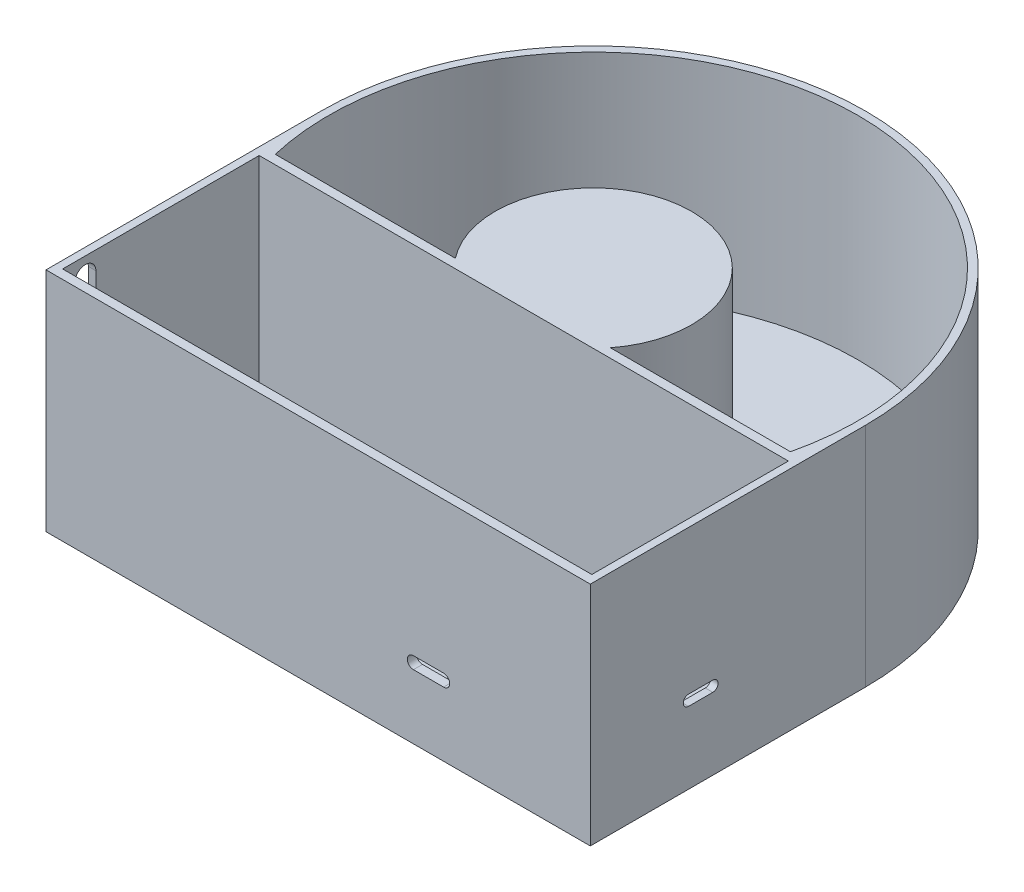
ISO-10303-21;
HEADER;
FILE_DESCRIPTION(('STEP AP214'),'2;1');
FILE_NAME('part.step','',(''),(''),'','','');
FILE_SCHEMA(('AUTOMOTIVE_DESIGN { 1 0 10303 214 1 1 1 1 }'));
ENDSEC;
DATA;
#1=APPLICATION_CONTEXT('core data for automotive mechanical design processes');
#2=APPLICATION_PROTOCOL_DEFINITION('international standard','automotive_design',2000,#1);
#3=PRODUCT_CONTEXT('',#1,'mechanical');
#4=PRODUCT('Part','Part','',(#3));
#5=PRODUCT_RELATED_PRODUCT_CATEGORY('part','',(#4));
#6=PRODUCT_DEFINITION_FORMATION('','',#4);
#7=PRODUCT_DEFINITION_CONTEXT('part definition',#1,'design');
#8=PRODUCT_DEFINITION('design','',#6,#7);
#9=PRODUCT_DEFINITION_SHAPE('','',#8);
#10=(LENGTH_UNIT() NAMED_UNIT(*) SI_UNIT(.MILLI.,.METRE.));
#11=(NAMED_UNIT(*) PLANE_ANGLE_UNIT() SI_UNIT($,.RADIAN.));
#12=(NAMED_UNIT(*) SI_UNIT($,.STERADIAN.) SOLID_ANGLE_UNIT());
#13=UNCERTAINTY_MEASURE_WITH_UNIT(LENGTH_MEASURE(1.E-05),#10,'distance_accuracy_value','');
#14=(GEOMETRIC_REPRESENTATION_CONTEXT(3) GLOBAL_UNCERTAINTY_ASSIGNED_CONTEXT((#13)) GLOBAL_UNIT_ASSIGNED_CONTEXT((#10,
#11,#12)) REPRESENTATION_CONTEXT('',''));
#15=CARTESIAN_POINT('',(0.,0.,0.));
#16=DIRECTION('',(0.,0.,1.));
#17=DIRECTION('',(1.,0.,0.));
#18=AXIS2_PLACEMENT_3D('',#15,#16,#17);
#19=CARTESIAN_POINT('',(0.,4.99999999999999,0.));
#20=DIRECTION('',(0.,1.,0.));
#21=DIRECTION('',(0.,0.,1.));
#22=AXIS2_PLACEMENT_3D('',#19,#20,#21);
#23=PLANE('',#22);
#24=DIRECTION('',(-1.,0.,0.));
#25=VECTOR('',#24,1.);
#26=CARTESIAN_POINT('',(0.,4.99999999999999,20.));
#27=LINE('',#26,#25);
#28=CARTESIAN_POINT('',(-76.4005010509516,4.99999999999999,20.));
#29=VERTEX_POINT('',#28);
#30=CARTESIAN_POINT('',(-85.1836251870041,4.99999999999999,20.));
#31=VERTEX_POINT('',#30);
#32=EDGE_CURVE('E518',#29,#31,#27,.T.);
#33=ORIENTED_EDGE('',*,*,#32,.F.);
#34=DIRECTION('',(0.,0.,1.));
#35=VECTOR('',#34,1.);
#36=CARTESIAN_POINT('',(-76.4005010509516,4.99999999999999,-30.));
#37=LINE('',#36,#35);
#38=CARTESIAN_POINT('',(-76.4005010509516,4.99999999999999,-30.));
#39=VERTEX_POINT('',#38);
#40=EDGE_CURVE('E283',#39,#29,#37,.T.);
#41=ORIENTED_EDGE('',*,*,#40,.F.);
#42=DIRECTION('',(-1.,0.,0.));
#43=VECTOR('',#42,1.);
#44=CARTESIAN_POINT('',(-76.4005010509516,4.99999999999999,-30.));
#45=LINE('',#44,#43);
#46=CARTESIAN_POINT('',(-75.4005010509516,5.,-30.));
#47=VERTEX_POINT('',#46);
#48=EDGE_CURVE('E306',#47,#39,#45,.T.);
#49=ORIENTED_EDGE('',*,*,#48,.F.);
#50=DIRECTION('',(0.,0.,1.));
#51=VECTOR('',#50,1.);
#52=CARTESIAN_POINT('',(-75.4005010509516,5.,-30.));
#53=LINE('',#52,#51);
#54=CARTESIAN_POINT('',(-75.4005010509515,5.,20.));
#55=VERTEX_POINT('',#54);
#56=EDGE_CURVE('E297',#47,#55,#53,.T.);
#57=ORIENTED_EDGE('',*,*,#56,.T.);
#58=CARTESIAN_POINT('',(-55.4005010509515,4.99999999999999,20.));
#59=VERTEX_POINT('',#58);
#60=EDGE_CURVE('E524',#59,#55,#27,.T.);
#61=ORIENTED_EDGE('',*,*,#60,.F.);
#62=DIRECTION('',(0.,0.,1.));
#63=VECTOR('',#62,1.);
#64=CARTESIAN_POINT('',(-55.4005010509516,4.99999999999999,-30.));
#65=LINE('',#64,#63);
#66=CARTESIAN_POINT('',(-55.4005010509516,4.99999999999999,-30.));
#67=VERTEX_POINT('',#66);
#68=EDGE_CURVE('E358',#67,#59,#65,.T.);
#69=ORIENTED_EDGE('',*,*,#68,.F.);
#70=DIRECTION('',(-1.,0.,0.));
#71=VECTOR('',#70,1.);
#72=CARTESIAN_POINT('',(-54.4005010509516,4.99999999999999,-30.));
#73=LINE('',#72,#71);
#74=CARTESIAN_POINT('',(-54.4005010509516,4.99999999999999,-30.));
#75=VERTEX_POINT('',#74);
#76=EDGE_CURVE('E325',#75,#67,#73,.T.);
#77=ORIENTED_EDGE('',*,*,#76,.F.);
#78=DIRECTION('',(0.,0.,1.));
#79=VECTOR('',#78,1.);
#80=CARTESIAN_POINT('',(-54.4005010509516,4.99999999999999,-30.));
#81=LINE('',#80,#79);
#82=CARTESIAN_POINT('',(-54.4005010509515,4.99999999999999,20.));
#83=VERTEX_POINT('',#82);
#84=EDGE_CURVE('E339',#75,#83,#81,.T.);
#85=ORIENTED_EDGE('',*,*,#84,.T.);
#86=CARTESIAN_POINT('',(-25.617376914899,4.99999999999999,20.));
#87=VERTEX_POINT('',#86);
#88=EDGE_CURVE('E519',#87,#83,#27,.T.);
#89=ORIENTED_EDGE('',*,*,#88,.F.);
#90=CARTESIAN_POINT('',(0.,4.99999999999999,0.));
#91=DIRECTION('',(0.,1.,0.));
#92=DIRECTION('',(0.,0.,1.));
#93=AXIS2_PLACEMENT_3D('',#90,#91,#92);
#94=CIRCLE('',#93,32.5);
#95=CARTESIAN_POINT('',(25.617376914899,4.99999999999999,20.));
#96=VERTEX_POINT('',#95);
#97=EDGE_CURVE('E536',#96,#87,#94,.T.);
#98=ORIENTED_EDGE('',*,*,#97,.F.);
#99=CARTESIAN_POINT('',(85.1836251870041,4.99999999999999,20.));
#100=VERTEX_POINT('',#99);
#101=EDGE_CURVE('E525',#100,#96,#27,.T.);
#102=ORIENTED_EDGE('',*,*,#101,.F.);
#103=CARTESIAN_POINT('',(0.,4.99999999999999,0.));
#104=DIRECTION('',(0.,1.,0.));
#105=DIRECTION('',(0.,0.,1.));
#106=AXIS2_PLACEMENT_3D('',#103,#104,#105);
#107=CIRCLE('',#106,87.5);
#108=EDGE_CURVE('E545',#100,#31,#107,.T.);
#109=ORIENTED_EDGE('',*,*,#108,.T.);
#110=EDGE_LOOP('',(#33,#41,#49,#57,#61,#69,#77,#85,#89,#98,#102,#109));
#111=FACE_BOUND('',#110,.T.);
#112=ADVANCED_FACE('F42',(#111),#23,.T.);
#113=CARTESIAN_POINT('',(-90.,0.,20.));
#114=DIRECTION('',(0.,0.,-1.));
#115=DIRECTION('',(-1.,0.,0.));
#116=AXIS2_PLACEMENT_3D('',#113,#114,#115);
#117=PLANE('',#116);
#118=DIRECTION('',(1.,0.,0.));
#119=VECTOR('',#118,1.);
#120=CARTESIAN_POINT('',(-73.6797717418984,7.45745613286697,20.));
#121=LINE('',#120,#119);
#122=CARTESIAN_POINT('',(-74.6797717418984,7.45745613286697,20.));
#123=VERTEX_POINT('',#122);
#124=CARTESIAN_POINT('',(-73.6797717418984,7.45745613286697,20.));
#125=VERTEX_POINT('',#124);
#126=EDGE_CURVE('E305',#123,#125,#121,.T.);
#127=ORIENTED_EDGE('',*,*,#126,.F.);
#128=DIRECTION('',(0.573576436351047,0.819152044288991,0.));
#129=VECTOR('',#128,1.);
#130=CARTESIAN_POINT('',(-74.6797717418984,7.45745613286697,20.));
#131=LINE('',#130,#129);
#132=EDGE_CURVE('E310',#29,#123,#131,.T.);
#133=ORIENTED_EDGE('',*,*,#132,.F.);
#134=ORIENTED_EDGE('',*,*,#32,.T.);
#135=DIRECTION('',(0.,1.,0.));
#136=VECTOR('',#135,1.);
#137=CARTESIAN_POINT('',(-85.1836251870041,4.99999999999999,20.));
#138=LINE('',#137,#136);
#139=CARTESIAN_POINT('',(-85.1836251870041,75.,20.));
#140=VERTEX_POINT('',#139);
#141=EDGE_CURVE('E523',#140,#31,#138,.F.);
#142=ORIENTED_EDGE('',*,*,#141,.F.);
#143=DIRECTION('',(-1.,0.,0.));
#144=VECTOR('',#143,1.);
#145=CARTESIAN_POINT('',(-90.,75.,20.));
#146=LINE('',#145,#144);
#147=CARTESIAN_POINT('',(-25.617376914899,75.,20.));
#148=VERTEX_POINT('',#147);
#149=EDGE_CURVE('E506',#148,#140,#146,.T.);
#150=ORIENTED_EDGE('',*,*,#149,.F.);
#151=DIRECTION('',(0.,-1.,0.));
#152=VECTOR('',#151,1.);
#153=CARTESIAN_POINT('',(-25.617376914899,75.,20.));
#154=LINE('',#153,#152);
#155=EDGE_CURVE('E513',#87,#148,#154,.F.);
#156=ORIENTED_EDGE('',*,*,#155,.F.);
#157=ORIENTED_EDGE('',*,*,#88,.T.);
#158=DIRECTION('',(0.573576436351044,-0.819152044288993,0.));
#159=VECTOR('',#158,1.);
#160=CARTESIAN_POINT('',(-56.1212303600047,7.45745613286697,20.));
#161=LINE('',#160,#159);
#162=CARTESIAN_POINT('',(-56.1212303600047,7.45745613286697,20.));
#163=VERTEX_POINT('',#162);
#164=EDGE_CURVE('E330',#163,#83,#161,.T.);
#165=ORIENTED_EDGE('',*,*,#164,.F.);
#166=DIRECTION('',(1.,0.,0.));
#167=VECTOR('',#166,1.);
#168=CARTESIAN_POINT('',(-57.1212303600047,7.45745613286697,20.));
#169=LINE('',#168,#167);
#170=CARTESIAN_POINT('',(-57.1212303600047,7.45745613286697,20.));
#171=VERTEX_POINT('',#170);
#172=EDGE_CURVE('E342',#171,#163,#169,.T.);
#173=ORIENTED_EDGE('',*,*,#172,.F.);
#174=DIRECTION('',(-0.573576436351043,0.819152044288994,0.));
#175=VECTOR('',#174,1.);
#176=CARTESIAN_POINT('',(-55.4005010509515,4.99999999999999,20.));
#177=LINE('',#176,#175);
#178=EDGE_CURVE('E313',#59,#171,#177,.T.);
#179=ORIENTED_EDGE('',*,*,#178,.F.);
#180=ORIENTED_EDGE('',*,*,#60,.T.);
#181=DIRECTION('',(-0.573576436351046,-0.819152044288992,0.));
#182=VECTOR('',#181,1.);
#183=CARTESIAN_POINT('',(-75.4005010509515,5.,20.));
#184=LINE('',#183,#182);
#185=EDGE_CURVE('E302',#125,#55,#184,.T.);
#186=ORIENTED_EDGE('',*,*,#185,.F.);
#187=EDGE_LOOP('',(#127,#133,#134,#142,#150,#156,#157,#165,#173,#179,#180,#186));
#188=FACE_BOUND('',#187,.T.);
#189=ADVANCED_FACE('F600',(#188),#117,.T.);
#190=CARTESIAN_POINT('',(0.,75.,0.));
#191=DIRECTION('',(0.,-1.,0.));
#192=DIRECTION('',(0.,0.,-1.));
#193=AXIS2_PLACEMENT_3D('',#190,#191,#192);
#194=CYLINDRICAL_SURFACE('',#193,90.);
#195=CARTESIAN_POINT('',(0.,75.,0.));
#196=DIRECTION('',(0.,1.,0.));
#197=DIRECTION('',(0.,0.,1.));
#198=AXIS2_PLACEMENT_3D('',#195,#196,#197);
#199=CIRCLE('',#198,90.);
#200=CARTESIAN_POINT('',(90.,75.,6.62908695073278E-13));
#201=VERTEX_POINT('',#200);
#202=CARTESIAN_POINT('',(-90.,75.,0.));
#203=VERTEX_POINT('',#202);
#204=EDGE_CURVE('E552',#201,#203,#199,.T.);
#205=ORIENTED_EDGE('',*,*,#204,.F.);
#206=DIRECTION('',(0.,1.,0.));
#207=VECTOR('',#206,1.);
#208=CARTESIAN_POINT('',(90.,75.,6.62908695073278E-13));
#209=LINE('',#208,#207);
#210=CARTESIAN_POINT('',(90.,0.,0.));
#211=VERTEX_POINT('',#210);
#212=EDGE_CURVE('E465',#211,#201,#209,.T.);
#213=ORIENTED_EDGE('',*,*,#212,.F.);
#214=CARTESIAN_POINT('',(0.,0.,0.));
#215=DIRECTION('',(0.,1.,0.));
#216=DIRECTION('',(0.,0.,1.));
#217=AXIS2_PLACEMENT_3D('',#214,#215,#216);
#218=CIRCLE('',#217,90.);
#219=CARTESIAN_POINT('',(-90.,0.,0.));
#220=VERTEX_POINT('',#219);
#221=EDGE_CURVE('E549',#211,#220,#218,.T.);
#222=ORIENTED_EDGE('',*,*,#221,.T.);
#223=DIRECTION('',(0.,-1.,0.));
#224=VECTOR('',#223,1.);
#225=CARTESIAN_POINT('',(-90.,75.,0.));
#226=LINE('',#225,#224);
#227=EDGE_CURVE('E478',#203,#220,#226,.T.);
#228=ORIENTED_EDGE('',*,*,#227,.F.);
#229=EDGE_LOOP('',(#205,#213,#222,#228));
#230=FACE_BOUND('',#229,.T.);
#231=ADVANCED_FACE('F44',(#230),#194,.T.);
#232=CARTESIAN_POINT('',(0.,75.,0.));
#233=DIRECTION('',(0.,1.,0.));
#234=DIRECTION('',(0.,0.,1.));
#235=AXIS2_PLACEMENT_3D('',#232,#233,#234);
#236=PLANE('',#235);
#237=DIRECTION('',(0.,0.,1.));
#238=VECTOR('',#237,1.);
#239=CARTESIAN_POINT('',(-87.5,75.,23.));
#240=LINE('',#239,#238);
#241=CARTESIAN_POINT('',(-87.5,75.,23.));
#242=VERTEX_POINT('',#241);
#243=CARTESIAN_POINT('',(-87.5,75.,88.));
#244=VERTEX_POINT('',#243);
#245=EDGE_CURVE('E430',#242,#244,#240,.T.);
#246=ORIENTED_EDGE('',*,*,#245,.F.);
#247=DIRECTION('',(-1.,0.,0.));
#248=VECTOR('',#247,1.);
#249=CARTESIAN_POINT('',(87.5,75.,23.));
#250=LINE('',#249,#248);
#251=CARTESIAN_POINT('',(87.5,75.,23.));
#252=VERTEX_POINT('',#251);
#253=EDGE_CURVE('E436',#252,#242,#250,.T.);
#254=ORIENTED_EDGE('',*,*,#253,.F.);
#255=DIRECTION('',(0.,0.,-1.));
#256=VECTOR('',#255,1.);
#257=CARTESIAN_POINT('',(87.5,75.,23.));
#258=LINE('',#257,#256);
#259=CARTESIAN_POINT('',(87.5,75.,87.9999999999999));
#260=VERTEX_POINT('',#259);
#261=EDGE_CURVE('E455',#260,#252,#258,.T.);
#262=ORIENTED_EDGE('',*,*,#261,.F.);
#263=DIRECTION('',(1.,0.,0.));
#264=VECTOR('',#263,1.);
#265=CARTESIAN_POINT('',(87.5,75.,87.9999999999999));
#266=LINE('',#265,#264);
#267=EDGE_CURVE('E451',#244,#260,#266,.T.);
#268=ORIENTED_EDGE('',*,*,#267,.F.);
#269=EDGE_LOOP('',(#246,#254,#262,#268));
#270=FACE_BOUND('',#269,.T.);
#271=DIRECTION('',(0.,0.,-1.));
#272=VECTOR('',#271,1.);
#273=CARTESIAN_POINT('',(90.,75.,20.));
#274=LINE('',#273,#272);
#275=CARTESIAN_POINT('',(90.,75.,91.));
#276=VERTEX_POINT('',#275);
#277=EDGE_CURVE('E503',#276,#201,#274,.T.);
#278=ORIENTED_EDGE('',*,*,#277,.T.);
#279=ORIENTED_EDGE('',*,*,#204,.T.);
#280=DIRECTION('',(0.,0.,1.));
#281=VECTOR('',#280,1.);
#282=CARTESIAN_POINT('',(-90.,75.,20.));
#283=LINE('',#282,#281);
#284=CARTESIAN_POINT('',(-90.,75.,91.));
#285=VERTEX_POINT('',#284);
#286=EDGE_CURVE('E482',#203,#285,#283,.T.);
#287=ORIENTED_EDGE('',*,*,#286,.T.);
#288=DIRECTION('',(1.,0.,0.));
#289=VECTOR('',#288,1.);
#290=CARTESIAN_POINT('',(-90.,75.,91.));
#291=LINE('',#290,#289);
#292=EDGE_CURVE('E499',#285,#276,#291,.T.);
#293=ORIENTED_EDGE('',*,*,#292,.T.);
#294=EDGE_LOOP('',(#278,#279,#287,#293));
#295=FACE_BOUND('',#294,.T.);
#296=CARTESIAN_POINT('',(0.,75.,0.));
#297=DIRECTION('',(0.,1.,0.));
#298=DIRECTION('',(0.,0.,1.));
#299=AXIS2_PLACEMENT_3D('',#296,#297,#298);
#300=CIRCLE('',#299,87.5);
#301=CARTESIAN_POINT('',(85.183625187004,75.,20.));
#302=VERTEX_POINT('',#301);
#303=EDGE_CURVE('E541',#302,#140,#300,.T.);
#304=ORIENTED_EDGE('',*,*,#303,.F.);
#305=CARTESIAN_POINT('',(25.617376914899,75.,20.));
#306=VERTEX_POINT('',#305);
#307=EDGE_CURVE('E488',#302,#306,#146,.T.);
#308=ORIENTED_EDGE('',*,*,#307,.T.);
#309=CARTESIAN_POINT('',(0.,75.,0.));
#310=DIRECTION('',(0.,1.,0.));
#311=DIRECTION('',(0.,0.,1.));
#312=AXIS2_PLACEMENT_3D('',#309,#310,#311);
#313=CIRCLE('',#312,32.5);
#314=EDGE_CURVE('E537',#306,#148,#313,.T.);
#315=ORIENTED_EDGE('',*,*,#314,.T.);
#316=ORIENTED_EDGE('',*,*,#149,.T.);
#317=EDGE_LOOP('',(#304,#308,#315,#316));
#318=FACE_BOUND('',#317,.T.);
#319=ADVANCED_FACE('F620',(#270,#295,#318),#236,.T.);
#320=CARTESIAN_POINT('',(0.,0.,0.));
#321=DIRECTION('',(0.,1.,0.));
#322=DIRECTION('',(0.,0.,1.));
#323=AXIS2_PLACEMENT_3D('',#320,#321,#322);
#324=PLANE('',#323);
#325=ORIENTED_EDGE('',*,*,#221,.F.);
#326=DIRECTION('',(0.,0.,-1.));
#327=VECTOR('',#326,1.);
#328=CARTESIAN_POINT('',(90.,0.,20.));
#329=LINE('',#328,#327);
#330=CARTESIAN_POINT('',(90.,0.,91.));
#331=VERTEX_POINT('',#330);
#332=EDGE_CURVE('E492',#331,#211,#329,.T.);
#333=ORIENTED_EDGE('',*,*,#332,.F.);
#334=DIRECTION('',(1.,0.,0.));
#335=VECTOR('',#334,1.);
#336=CARTESIAN_POINT('',(-90.,0.,91.));
#337=LINE('',#336,#335);
#338=CARTESIAN_POINT('',(-90.,0.,91.));
#339=VERTEX_POINT('',#338);
#340=EDGE_CURVE('E487',#339,#331,#337,.T.);
#341=ORIENTED_EDGE('',*,*,#340,.F.);
#342=DIRECTION('',(0.,0.,1.));
#343=VECTOR('',#342,1.);
#344=CARTESIAN_POINT('',(-90.,0.,20.));
#345=LINE('',#344,#343);
#346=EDGE_CURVE('E483',#220,#339,#345,.T.);
#347=ORIENTED_EDGE('',*,*,#346,.F.);
#348=EDGE_LOOP('',(#325,#333,#341,#347));
#349=FACE_BOUND('',#348,.T.);
#350=ADVANCED_FACE('F618',(#349),#324,.F.);
#351=CARTESIAN_POINT('',(0.,4.99999999999999,0.));
#352=DIRECTION('',(0.,1.,0.));
#353=DIRECTION('',(0.,0.,1.));
#354=AXIS2_PLACEMENT_3D('',#351,#352,#353);
#355=CYLINDRICAL_SURFACE('',#354,87.5);
#356=ORIENTED_EDGE('',*,*,#303,.T.);
#357=ORIENTED_EDGE('',*,*,#141,.T.);
#358=ORIENTED_EDGE('',*,*,#108,.F.);
#359=DIRECTION('',(0.,1.,0.));
#360=VECTOR('',#359,1.);
#361=CARTESIAN_POINT('',(85.1836251870041,4.99999999999999,20.));
#362=LINE('',#361,#360);
#363=EDGE_CURVE('E532',#100,#302,#362,.T.);
#364=ORIENTED_EDGE('',*,*,#363,.T.);
#365=EDGE_LOOP('',(#356,#357,#358,#364));
#366=FACE_BOUND('',#365,.T.);
#367=ADVANCED_FACE('F615',(#366),#355,.F.);
#368=CARTESIAN_POINT('',(0.,75.,0.));
#369=DIRECTION('',(0.,-1.,0.));
#370=DIRECTION('',(0.,0.,-1.));
#371=AXIS2_PLACEMENT_3D('',#368,#369,#370);
#372=CYLINDRICAL_SURFACE('',#371,32.5);
#373=ORIENTED_EDGE('',*,*,#314,.F.);
#374=DIRECTION('',(0.,-1.,0.));
#375=VECTOR('',#374,1.);
#376=CARTESIAN_POINT('',(25.617376914899,75.,20.));
#377=LINE('',#376,#375);
#378=EDGE_CURVE('E529',#306,#96,#377,.T.);
#379=ORIENTED_EDGE('',*,*,#378,.T.);
#380=ORIENTED_EDGE('',*,*,#97,.T.);
#381=ORIENTED_EDGE('',*,*,#155,.T.);
#382=EDGE_LOOP('',(#373,#379,#380,#381));
#383=FACE_BOUND('',#382,.T.);
#384=ADVANCED_FACE('F613',(#383),#372,.T.);
#385=ORIENTED_EDGE('',*,*,#363,.F.);
#386=ORIENTED_EDGE('',*,*,#101,.T.);
#387=ORIENTED_EDGE('',*,*,#378,.F.);
#388=ORIENTED_EDGE('',*,*,#307,.F.);
#389=EDGE_LOOP('',(#385,#386,#387,#388));
#390=FACE_BOUND('',#389,.T.);
#391=ADVANCED_FACE('F609',(#390),#117,.T.);
#392=CARTESIAN_POINT('',(-90.,0.,20.));
#393=DIRECTION('',(-1.,0.,0.));
#394=DIRECTION('',(0.,0.,1.));
#395=AXIS2_PLACEMENT_3D('',#392,#393,#394);
#396=PLANE('',#395);
#397=CARTESIAN_POINT('',(-90.,69.,80.5));
#398=DIRECTION('',(-1.,0.,0.));
#399=DIRECTION('',(0.,0.,1.));
#400=AXIS2_PLACEMENT_3D('',#397,#398,#399);
#401=CIRCLE('',#400,3.49999999999999);
#402=CARTESIAN_POINT('',(-90.,69.,84.));
#403=VERTEX_POINT('',#402);
#404=CARTESIAN_POINT('',(-90.,69.,77.));
#405=VERTEX_POINT('',#404);
#406=EDGE_CURVE('E58',#403,#405,#401,.T.);
#407=ORIENTED_EDGE('',*,*,#406,.F.);
#408=DIRECTION('',(0.,1.,0.));
#409=VECTOR('',#408,1.);
#410=CARTESIAN_POINT('',(-90.,69.,84.));
#411=LINE('',#410,#409);
#412=CARTESIAN_POINT('',(-90.,54.,84.));
#413=VERTEX_POINT('',#412);
#414=EDGE_CURVE('E273',#413,#403,#411,.T.);
#415=ORIENTED_EDGE('',*,*,#414,.F.);
#416=CARTESIAN_POINT('',(-90.,54.,80.5));
#417=DIRECTION('',(-1.,0.,0.));
#418=DIRECTION('',(0.,0.,1.));
#419=AXIS2_PLACEMENT_3D('',#416,#417,#418);
#420=CIRCLE('',#419,3.5);
#421=CARTESIAN_POINT('',(-90.,54.,77.));
#422=VERTEX_POINT('',#421);
#423=EDGE_CURVE('E255',#422,#413,#420,.T.);
#424=ORIENTED_EDGE('',*,*,#423,.F.);
#425=DIRECTION('',(0.,-1.,0.));
#426=VECTOR('',#425,1.);
#427=CARTESIAN_POINT('',(-90.,69.,77.));
#428=LINE('',#427,#426);
#429=EDGE_CURVE('E265',#405,#422,#428,.T.);
#430=ORIENTED_EDGE('',*,*,#429,.F.);
#431=EDGE_LOOP('',(#407,#415,#424,#430));
#432=FACE_BOUND('',#431,.T.);
#433=ORIENTED_EDGE('',*,*,#286,.F.);
#434=ORIENTED_EDGE('',*,*,#227,.T.);
#435=ORIENTED_EDGE('',*,*,#346,.T.);
#436=DIRECTION('',(0.,1.,0.));
#437=VECTOR('',#436,1.);
#438=CARTESIAN_POINT('',(-90.,0.,91.));
#439=LINE('',#438,#437);
#440=EDGE_CURVE('E495',#339,#285,#439,.T.);
#441=ORIENTED_EDGE('',*,*,#440,.T.);
#442=EDGE_LOOP('',(#433,#434,#435,#441));
#443=FACE_BOUND('',#442,.T.);
#444=ADVANCED_FACE('F270',(#432,#443),#396,.T.);
#445=CARTESIAN_POINT('',(90.,0.,20.));
#446=DIRECTION('',(1.,0.,0.));
#447=DIRECTION('',(0.,0.,-1.));
#448=AXIS2_PLACEMENT_3D('',#445,#446,#447);
#449=PLANE('',#448);
#450=CARTESIAN_POINT('',(90.,25.5,50.4999999999999));
#451=DIRECTION('',(1.,0.,0.));
#452=DIRECTION('',(0.,0.,-1.));
#453=AXIS2_PLACEMENT_3D('',#450,#451,#452);
#454=CIRCLE('',#453,1.75000000000001);
#455=CARTESIAN_POINT('',(90.,23.75,50.4999999999999));
#456=VERTEX_POINT('',#455);
#457=CARTESIAN_POINT('',(90.,27.25,50.4999999999999));
#458=VERTEX_POINT('',#457);
#459=EDGE_CURVE('E427',#456,#458,#454,.T.);
#460=ORIENTED_EDGE('',*,*,#459,.F.);
#461=DIRECTION('',(0.,0.,-1.));
#462=VECTOR('',#461,1.);
#463=CARTESIAN_POINT('',(90.,23.75,20.));
#464=LINE('',#463,#462);
#465=CARTESIAN_POINT('',(90.,23.75,58.4999999999999));
#466=VERTEX_POINT('',#465);
#467=EDGE_CURVE('E408',#466,#456,#464,.T.);
#468=ORIENTED_EDGE('',*,*,#467,.F.);
#469=CARTESIAN_POINT('',(90.,25.5,58.4999999999999));
#470=DIRECTION('',(1.,0.,0.));
#471=DIRECTION('',(0.,0.,-1.));
#472=AXIS2_PLACEMENT_3D('',#469,#470,#471);
#473=CIRCLE('',#472,1.75000000000001);
#474=CARTESIAN_POINT('',(90.,27.25,58.4999999999999));
#475=VERTEX_POINT('',#474);
#476=EDGE_CURVE('E420',#475,#466,#473,.T.);
#477=ORIENTED_EDGE('',*,*,#476,.F.);
#478=DIRECTION('',(0.,0.,1.));
#479=VECTOR('',#478,1.);
#480=CARTESIAN_POINT('',(90.,27.25,20.));
#481=LINE('',#480,#479);
#482=EDGE_CURVE('E424',#458,#475,#481,.T.);
#483=ORIENTED_EDGE('',*,*,#482,.F.);
#484=EDGE_LOOP('',(#460,#468,#477,#483));
#485=FACE_BOUND('',#484,.T.);
#486=ORIENTED_EDGE('',*,*,#277,.F.);
#487=DIRECTION('',(0.,1.,0.));
#488=VECTOR('',#487,1.);
#489=CARTESIAN_POINT('',(90.,0.,91.));
#490=LINE('',#489,#488);
#491=EDGE_CURVE('E510',#331,#276,#490,.T.);
#492=ORIENTED_EDGE('',*,*,#491,.F.);
#493=ORIENTED_EDGE('',*,*,#332,.T.);
#494=ORIENTED_EDGE('',*,*,#212,.T.);
#495=EDGE_LOOP('',(#486,#492,#493,#494));
#496=FACE_BOUND('',#495,.T.);
#497=ADVANCED_FACE('F638',(#485,#496),#449,.T.);
#498=CARTESIAN_POINT('',(-90.,0.,91.));
#499=DIRECTION('',(0.,0.,1.));
#500=DIRECTION('',(1.,0.,0.));
#501=AXIS2_PLACEMENT_3D('',#498,#499,#500);
#502=PLANE('',#501);
#503=CARTESIAN_POINT('',(41.5,23.25,91.));
#504=DIRECTION('',(0.,0.,1.));
#505=DIRECTION('',(1.,0.,0.));
#506=AXIS2_PLACEMENT_3D('',#503,#504,#505);
#507=CIRCLE('',#506,2.);
#508=CARTESIAN_POINT('',(41.5,21.25,91.));
#509=VERTEX_POINT('',#508);
#510=CARTESIAN_POINT('',(41.5,25.25,91.));
#511=VERTEX_POINT('',#510);
#512=EDGE_CURVE('E361',#509,#511,#507,.T.);
#513=ORIENTED_EDGE('',*,*,#512,.F.);
#514=DIRECTION('',(1.,0.,0.));
#515=VECTOR('',#514,1.);
#516=CARTESIAN_POINT('',(41.5,21.25,91.));
#517=LINE('',#516,#515);
#518=CARTESIAN_POINT('',(31.5,21.25,91.));
#519=VERTEX_POINT('',#518);
#520=EDGE_CURVE('E372',#519,#509,#517,.T.);
#521=ORIENTED_EDGE('',*,*,#520,.F.);
#522=CARTESIAN_POINT('',(31.5,23.25,91.));
#523=DIRECTION('',(0.,0.,1.));
#524=DIRECTION('',(1.,0.,0.));
#525=AXIS2_PLACEMENT_3D('',#522,#523,#524);
#526=CIRCLE('',#525,2.);
#527=CARTESIAN_POINT('',(31.5,25.25,91.));
#528=VERTEX_POINT('',#527);
#529=EDGE_CURVE('E368',#528,#519,#526,.T.);
#530=ORIENTED_EDGE('',*,*,#529,.F.);
#531=DIRECTION('',(-1.,0.,0.));
#532=VECTOR('',#531,1.);
#533=CARTESIAN_POINT('',(41.5,25.25,91.));
#534=LINE('',#533,#532);
#535=EDGE_CURVE('E364',#511,#528,#534,.T.);
#536=ORIENTED_EDGE('',*,*,#535,.F.);
#537=EDGE_LOOP('',(#513,#521,#530,#536));
#538=FACE_BOUND('',#537,.T.);
#539=ORIENTED_EDGE('',*,*,#292,.F.);
#540=ORIENTED_EDGE('',*,*,#440,.F.);
#541=ORIENTED_EDGE('',*,*,#340,.T.);
#542=ORIENTED_EDGE('',*,*,#491,.T.);
#543=EDGE_LOOP('',(#539,#540,#541,#542));
#544=FACE_BOUND('',#543,.T.);
#545=ADVANCED_FACE('F641',(#538,#544),#502,.T.);
#546=CARTESIAN_POINT('',(-87.5,4.99999999999999,23.));
#547=DIRECTION('',(-1.,0.,0.));
#548=DIRECTION('',(0.,0.,1.));
#549=AXIS2_PLACEMENT_3D('',#546,#547,#548);
#550=PLANE('',#549);
#551=DIRECTION('',(0.,1.,0.));
#552=VECTOR('',#551,1.);
#553=CARTESIAN_POINT('',(-87.5,5.00000000000005,84.));
#554=LINE('',#553,#552);
#555=CARTESIAN_POINT('',(-87.5,54.,84.));
#556=VERTEX_POINT('',#555);
#557=CARTESIAN_POINT('',(-87.5,69.,84.));
#558=VERTEX_POINT('',#557);
#559=EDGE_CURVE('E51',#556,#558,#554,.T.);
#560=ORIENTED_EDGE('',*,*,#559,.T.);
#561=CARTESIAN_POINT('',(-87.5,69.,80.5));
#562=DIRECTION('',(-1.,0.,0.));
#563=DIRECTION('',(0.,0.,1.));
#564=AXIS2_PLACEMENT_3D('',#561,#562,#563);
#565=CIRCLE('',#564,3.49999999999999);
#566=CARTESIAN_POINT('',(-87.5,69.,77.));
#567=VERTEX_POINT('',#566);
#568=EDGE_CURVE('E11',#558,#567,#565,.T.);
#569=ORIENTED_EDGE('',*,*,#568,.T.);
#570=DIRECTION('',(0.,-1.,0.));
#571=VECTOR('',#570,1.);
#572=CARTESIAN_POINT('',(-87.5,4.99999999999994,76.9999999999999));
#573=LINE('',#572,#571);
#574=CARTESIAN_POINT('',(-87.5,54.,77.));
#575=VERTEX_POINT('',#574);
#576=EDGE_CURVE('E573',#567,#575,#573,.T.);
#577=ORIENTED_EDGE('',*,*,#576,.T.);
#578=CARTESIAN_POINT('',(-87.5,54.,80.5));
#579=DIRECTION('',(-1.,0.,0.));
#580=DIRECTION('',(0.,0.,1.));
#581=AXIS2_PLACEMENT_3D('',#578,#579,#580);
#582=CIRCLE('',#581,3.5);
#583=EDGE_CURVE('E258',#575,#556,#582,.T.);
#584=ORIENTED_EDGE('',*,*,#583,.T.);
#585=EDGE_LOOP('',(#560,#569,#577,#584));
#586=FACE_BOUND('',#585,.T.);
#587=ORIENTED_EDGE('',*,*,#245,.T.);
#588=DIRECTION('',(0.,1.,0.));
#589=VECTOR('',#588,1.);
#590=CARTESIAN_POINT('',(-87.5,4.99999999999999,88.));
#591=LINE('',#590,#589);
#592=CARTESIAN_POINT('',(-87.5,4.99999999999999,88.));
#593=VERTEX_POINT('',#592);
#594=EDGE_CURVE('E448',#593,#244,#591,.T.);
#595=ORIENTED_EDGE('',*,*,#594,.F.);
#596=DIRECTION('',(0.,0.,1.));
#597=VECTOR('',#596,1.);
#598=CARTESIAN_POINT('',(-87.5,4.99999999999999,23.));
#599=LINE('',#598,#597);
#600=CARTESIAN_POINT('',(-87.5,4.99999999999999,23.));
#601=VERTEX_POINT('',#600);
#602=EDGE_CURVE('E431',#601,#593,#599,.T.);
#603=ORIENTED_EDGE('',*,*,#602,.F.);
#604=DIRECTION('',(0.,1.,0.));
#605=VECTOR('',#604,1.);
#606=CARTESIAN_POINT('',(-87.5,4.99999999999999,23.));
#607=LINE('',#606,#605);
#608=EDGE_CURVE('E462',#601,#242,#607,.T.);
#609=ORIENTED_EDGE('',*,*,#608,.T.);
#610=EDGE_LOOP('',(#587,#595,#603,#609));
#611=FACE_BOUND('',#610,.T.);
#612=ADVANCED_FACE('F580',(#586,#611),#550,.F.);
#613=CARTESIAN_POINT('',(87.5,4.99999999999999,23.));
#614=DIRECTION('',(0.,0.,-1.));
#615=DIRECTION('',(-1.,0.,0.));
#616=AXIS2_PLACEMENT_3D('',#613,#614,#615);
#617=PLANE('',#616);
#618=ORIENTED_EDGE('',*,*,#253,.T.);
#619=ORIENTED_EDGE('',*,*,#608,.F.);
#620=DIRECTION('',(-1.,0.,0.));
#621=VECTOR('',#620,1.);
#622=CARTESIAN_POINT('',(87.5,4.99999999999999,23.));
#623=LINE('',#622,#621);
#624=CARTESIAN_POINT('',(87.5,4.99999999999999,23.));
#625=VERTEX_POINT('',#624);
#626=EDGE_CURVE('E444',#625,#601,#623,.T.);
#627=ORIENTED_EDGE('',*,*,#626,.F.);
#628=DIRECTION('',(0.,1.,0.));
#629=VECTOR('',#628,1.);
#630=CARTESIAN_POINT('',(87.5,4.99999999999999,23.));
#631=LINE('',#630,#629);
#632=EDGE_CURVE('E466',#625,#252,#631,.T.);
#633=ORIENTED_EDGE('',*,*,#632,.T.);
#634=EDGE_LOOP('',(#618,#619,#627,#633));
#635=FACE_BOUND('',#634,.T.);
#636=ADVANCED_FACE('F742',(#635),#617,.F.);
#637=CARTESIAN_POINT('',(87.5,4.99999999999999,23.));
#638=DIRECTION('',(1.,0.,0.));
#639=DIRECTION('',(0.,0.,-1.));
#640=AXIS2_PLACEMENT_3D('',#637,#638,#639);
#641=PLANE('',#640);
#642=DIRECTION('',(0.,0.,1.));
#643=VECTOR('',#642,1.);
#644=CARTESIAN_POINT('',(87.5,23.75,50.4999999999999));
#645=LINE('',#644,#643);
#646=CARTESIAN_POINT('',(87.5,23.75,50.4999999999999));
#647=VERTEX_POINT('',#646);
#648=CARTESIAN_POINT('',(87.5,23.75,58.4999999999999));
#649=VERTEX_POINT('',#648);
#650=EDGE_CURVE('E392',#647,#649,#645,.T.);
#651=ORIENTED_EDGE('',*,*,#650,.F.);
#652=CARTESIAN_POINT('',(87.5,25.5,50.4999999999999));
#653=DIRECTION('',(-1.,0.,0.));
#654=DIRECTION('',(0.,0.,1.));
#655=AXIS2_PLACEMENT_3D('',#652,#653,#654);
#656=CIRCLE('',#655,1.75000000000001);
#657=CARTESIAN_POINT('',(87.5,27.25,50.4999999999999));
#658=VERTEX_POINT('',#657);
#659=EDGE_CURVE('E380',#658,#647,#656,.T.);
#660=ORIENTED_EDGE('',*,*,#659,.F.);
#661=DIRECTION('',(0.,0.,-1.));
#662=VECTOR('',#661,1.);
#663=CARTESIAN_POINT('',(87.5,27.25,50.4999999999999));
#664=LINE('',#663,#662);
#665=CARTESIAN_POINT('',(87.5,27.25,58.4999999999999));
#666=VERTEX_POINT('',#665);
#667=EDGE_CURVE('E400',#666,#658,#664,.T.);
#668=ORIENTED_EDGE('',*,*,#667,.F.);
#669=CARTESIAN_POINT('',(87.5,25.5,58.4999999999999));
#670=DIRECTION('',(-1.,0.,0.));
#671=DIRECTION('',(0.,0.,1.));
#672=AXIS2_PLACEMENT_3D('',#669,#670,#671);
#673=CIRCLE('',#672,1.75000000000001);
#674=EDGE_CURVE('E396',#649,#666,#673,.T.);
#675=ORIENTED_EDGE('',*,*,#674,.F.);
#676=EDGE_LOOP('',(#651,#660,#668,#675));
#677=FACE_BOUND('',#676,.T.);
#678=ORIENTED_EDGE('',*,*,#261,.T.);
#679=ORIENTED_EDGE('',*,*,#632,.F.);
#680=DIRECTION('',(0.,0.,-1.));
#681=VECTOR('',#680,1.);
#682=CARTESIAN_POINT('',(87.5,4.99999999999999,23.));
#683=LINE('',#682,#681);
#684=CARTESIAN_POINT('',(87.5,4.99999999999999,87.9999999999999));
#685=VERTEX_POINT('',#684);
#686=EDGE_CURVE('E440',#685,#625,#683,.T.);
#687=ORIENTED_EDGE('',*,*,#686,.F.);
#688=DIRECTION('',(0.,1.,0.));
#689=VECTOR('',#688,1.);
#690=CARTESIAN_POINT('',(87.5,4.99999999999999,87.9999999999999));
#691=LINE('',#690,#689);
#692=EDGE_CURVE('E469',#685,#260,#691,.T.);
#693=ORIENTED_EDGE('',*,*,#692,.T.);
#694=EDGE_LOOP('',(#678,#679,#687,#693));
#695=FACE_BOUND('',#694,.T.);
#696=ADVANCED_FACE('F745',(#677,#695),#641,.F.);
#697=CARTESIAN_POINT('',(87.5,4.99999999999999,87.9999999999999));
#698=DIRECTION('',(0.,0.,1.));
#699=DIRECTION('',(1.,0.,0.));
#700=AXIS2_PLACEMENT_3D('',#697,#698,#699);
#701=PLANE('',#700);
#702=DIRECTION('',(1.,0.,0.));
#703=VECTOR('',#702,1.);
#704=CARTESIAN_POINT('',(87.5,21.25,87.9999999999999));
#705=LINE('',#704,#703);
#706=CARTESIAN_POINT('',(31.5,21.25,88.));
#707=VERTEX_POINT('',#706);
#708=CARTESIAN_POINT('',(41.5,21.25,88.));
#709=VERTEX_POINT('',#708);
#710=EDGE_CURVE('E565',#707,#709,#705,.T.);
#711=ORIENTED_EDGE('',*,*,#710,.T.);
#712=CARTESIAN_POINT('',(41.5,23.25,88.));
#713=DIRECTION('',(0.,0.,1.));
#714=DIRECTION('',(1.,0.,0.));
#715=AXIS2_PLACEMENT_3D('',#712,#713,#714);
#716=CIRCLE('',#715,2.);
#717=CARTESIAN_POINT('',(41.5,25.25,88.));
#718=VERTEX_POINT('',#717);
#719=EDGE_CURVE('E569',#709,#718,#716,.T.);
#720=ORIENTED_EDGE('',*,*,#719,.T.);
#721=DIRECTION('',(-1.,0.,0.));
#722=VECTOR('',#721,1.);
#723=CARTESIAN_POINT('',(87.5,25.25,87.9999999999999));
#724=LINE('',#723,#722);
#725=CARTESIAN_POINT('',(31.5,25.25,88.));
#726=VERTEX_POINT('',#725);
#727=EDGE_CURVE('E555',#718,#726,#724,.T.);
#728=ORIENTED_EDGE('',*,*,#727,.T.);
#729=CARTESIAN_POINT('',(31.5,23.25,88.));
#730=DIRECTION('',(0.,0.,1.));
#731=DIRECTION('',(1.,0.,0.));
#732=AXIS2_PLACEMENT_3D('',#729,#730,#731);
#733=CIRCLE('',#732,2.);
#734=EDGE_CURVE('E561',#726,#707,#733,.T.);
#735=ORIENTED_EDGE('',*,*,#734,.T.);
#736=EDGE_LOOP('',(#711,#720,#728,#735));
#737=FACE_BOUND('',#736,.T.);
#738=ORIENTED_EDGE('',*,*,#267,.T.);
#739=ORIENTED_EDGE('',*,*,#692,.F.);
#740=DIRECTION('',(1.,0.,0.));
#741=VECTOR('',#740,1.);
#742=CARTESIAN_POINT('',(87.5,4.99999999999999,87.9999999999999));
#743=LINE('',#742,#741);
#744=EDGE_CURVE('E435',#593,#685,#743,.T.);
#745=ORIENTED_EDGE('',*,*,#744,.F.);
#746=ORIENTED_EDGE('',*,*,#594,.T.);
#747=EDGE_LOOP('',(#738,#739,#745,#746));
#748=FACE_BOUND('',#747,.T.);
#749=ADVANCED_FACE('F740',(#737,#748),#701,.F.);
#750=CARTESIAN_POINT('',(0.,4.99999999999999,0.));
#751=DIRECTION('',(0.,-1.,0.));
#752=DIRECTION('',(0.,0.,-1.));
#753=AXIS2_PLACEMENT_3D('',#750,#751,#752);
#754=PLANE('',#753);
#755=ORIENTED_EDGE('',*,*,#602,.T.);
#756=ORIENTED_EDGE('',*,*,#744,.T.);
#757=ORIENTED_EDGE('',*,*,#686,.T.);
#758=ORIENTED_EDGE('',*,*,#626,.T.);
#759=EDGE_LOOP('',(#755,#756,#757,#758));
#760=FACE_BOUND('',#759,.T.);
#761=ADVANCED_FACE('F736',(#760),#754,.F.);
#762=CARTESIAN_POINT('',(157.5,25.5,50.4999999999999));
#763=DIRECTION('',(-1.,0.,0.));
#764=DIRECTION('',(0.,0.,1.));
#765=AXIS2_PLACEMENT_3D('',#762,#763,#764);
#766=CYLINDRICAL_SURFACE('',#765,1.75000000000001);
#767=ORIENTED_EDGE('',*,*,#459,.T.);
#768=DIRECTION('',(-1.,0.,0.));
#769=VECTOR('',#768,1.);
#770=CARTESIAN_POINT('',(157.5,27.25,50.4999999999999));
#771=LINE('',#770,#769);
#772=EDGE_CURVE('E405',#458,#658,#771,.T.);
#773=ORIENTED_EDGE('',*,*,#772,.T.);
#774=ORIENTED_EDGE('',*,*,#659,.T.);
#775=DIRECTION('',(-1.,0.,0.));
#776=VECTOR('',#775,1.);
#777=CARTESIAN_POINT('',(157.5,23.75,50.4999999999999));
#778=LINE('',#777,#776);
#779=EDGE_CURVE('E404',#456,#647,#778,.T.);
#780=ORIENTED_EDGE('',*,*,#779,.F.);
#781=EDGE_LOOP('',(#767,#773,#774,#780));
#782=FACE_BOUND('',#781,.T.);
#783=ADVANCED_FACE('F726',(#782),#766,.F.);
#784=CARTESIAN_POINT('',(157.5,27.25,50.4999999999999));
#785=DIRECTION('',(0.,1.,0.));
#786=DIRECTION('',(0.,0.,1.));
#787=AXIS2_PLACEMENT_3D('',#784,#785,#786);
#788=PLANE('',#787);
#789=ORIENTED_EDGE('',*,*,#482,.T.);
#790=DIRECTION('',(-1.,0.,0.));
#791=VECTOR('',#790,1.);
#792=CARTESIAN_POINT('',(157.5,27.25,58.4999999999999));
#793=LINE('',#792,#791);
#794=EDGE_CURVE('E409',#475,#666,#793,.T.);
#795=ORIENTED_EDGE('',*,*,#794,.T.);
#796=ORIENTED_EDGE('',*,*,#667,.T.);
#797=ORIENTED_EDGE('',*,*,#772,.F.);
#798=EDGE_LOOP('',(#789,#795,#796,#797));
#799=FACE_BOUND('',#798,.T.);
#800=ADVANCED_FACE('F722',(#799),#788,.F.);
#801=CARTESIAN_POINT('',(157.5,25.5,58.4999999999999));
#802=DIRECTION('',(-1.,0.,0.));
#803=DIRECTION('',(0.,0.,1.));
#804=AXIS2_PLACEMENT_3D('',#801,#802,#803);
#805=CYLINDRICAL_SURFACE('',#804,1.75000000000001);
#806=ORIENTED_EDGE('',*,*,#476,.T.);
#807=DIRECTION('',(-1.,0.,0.));
#808=VECTOR('',#807,1.);
#809=CARTESIAN_POINT('',(157.5,23.75,58.4999999999999));
#810=LINE('',#809,#808);
#811=EDGE_CURVE('E412',#466,#649,#810,.T.);
#812=ORIENTED_EDGE('',*,*,#811,.T.);
#813=ORIENTED_EDGE('',*,*,#674,.T.);
#814=ORIENTED_EDGE('',*,*,#794,.F.);
#815=EDGE_LOOP('',(#806,#812,#813,#814));
#816=FACE_BOUND('',#815,.T.);
#817=ADVANCED_FACE('F725',(#816),#805,.F.);
#818=CARTESIAN_POINT('',(157.5,23.75,50.4999999999999));
#819=DIRECTION('',(0.,-1.,0.));
#820=DIRECTION('',(0.,0.,-1.));
#821=AXIS2_PLACEMENT_3D('',#818,#819,#820);
#822=PLANE('',#821);
#823=ORIENTED_EDGE('',*,*,#467,.T.);
#824=ORIENTED_EDGE('',*,*,#779,.T.);
#825=ORIENTED_EDGE('',*,*,#650,.T.);
#826=ORIENTED_EDGE('',*,*,#811,.F.);
#827=EDGE_LOOP('',(#823,#824,#825,#826));
#828=FACE_BOUND('',#827,.T.);
#829=ADVANCED_FACE('F720',(#828),#822,.F.);
#830=CARTESIAN_POINT('',(41.5,23.25,81.));
#831=DIRECTION('',(0.,0.,1.));
#832=DIRECTION('',(1.,0.,0.));
#833=AXIS2_PLACEMENT_3D('',#830,#831,#832);
#834=CYLINDRICAL_SURFACE('',#833,2.);
#835=DIRECTION('',(0.,0.,1.));
#836=VECTOR('',#835,1.);
#837=CARTESIAN_POINT('',(41.5,21.25,81.));
#838=LINE('',#837,#836);
#839=EDGE_CURVE('E377',#709,#509,#838,.T.);
#840=ORIENTED_EDGE('',*,*,#839,.T.);
#841=ORIENTED_EDGE('',*,*,#512,.T.);
#842=DIRECTION('',(0.,0.,1.));
#843=VECTOR('',#842,1.);
#844=CARTESIAN_POINT('',(41.5,25.25,81.));
#845=LINE('',#844,#843);
#846=EDGE_CURVE('E376',#718,#511,#845,.T.);
#847=ORIENTED_EDGE('',*,*,#846,.F.);
#848=ORIENTED_EDGE('',*,*,#719,.F.);
#849=EDGE_LOOP('',(#840,#841,#847,#848));
#850=FACE_BOUND('',#849,.T.);
#851=ADVANCED_FACE('F710',(#850),#834,.F.);
#852=CARTESIAN_POINT('',(41.5,21.25,81.));
#853=DIRECTION('',(0.,-1.,0.));
#854=DIRECTION('',(1.,0.,0.));
#855=AXIS2_PLACEMENT_3D('',#852,#853,#854);
#856=PLANE('',#855);
#857=DIRECTION('',(0.,0.,1.));
#858=VECTOR('',#857,1.);
#859=CARTESIAN_POINT('',(31.5,21.25,81.));
#860=LINE('',#859,#858);
#861=EDGE_CURVE('E381',#707,#519,#860,.T.);
#862=ORIENTED_EDGE('',*,*,#861,.T.);
#863=ORIENTED_EDGE('',*,*,#520,.T.);
#864=ORIENTED_EDGE('',*,*,#839,.F.);
#865=ORIENTED_EDGE('',*,*,#710,.F.);
#866=EDGE_LOOP('',(#862,#863,#864,#865));
#867=FACE_BOUND('',#866,.T.);
#868=ADVANCED_FACE('F706',(#867),#856,.F.);
#869=CARTESIAN_POINT('',(31.5,23.25,81.));
#870=DIRECTION('',(0.,0.,1.));
#871=DIRECTION('',(1.,0.,0.));
#872=AXIS2_PLACEMENT_3D('',#869,#870,#871);
#873=CYLINDRICAL_SURFACE('',#872,2.);
#874=DIRECTION('',(0.,0.,1.));
#875=VECTOR('',#874,1.);
#876=CARTESIAN_POINT('',(31.5,25.25,81.));
#877=LINE('',#876,#875);
#878=EDGE_CURVE('E384',#726,#528,#877,.T.);
#879=ORIENTED_EDGE('',*,*,#878,.T.);
#880=ORIENTED_EDGE('',*,*,#529,.T.);
#881=ORIENTED_EDGE('',*,*,#861,.F.);
#882=ORIENTED_EDGE('',*,*,#734,.F.);
#883=EDGE_LOOP('',(#879,#880,#881,#882));
#884=FACE_BOUND('',#883,.T.);
#885=ADVANCED_FACE('F709',(#884),#873,.F.);
#886=CARTESIAN_POINT('',(41.5,25.25,81.));
#887=DIRECTION('',(0.,1.,0.));
#888=DIRECTION('',(-1.,0.,0.));
#889=AXIS2_PLACEMENT_3D('',#886,#887,#888);
#890=PLANE('',#889);
#891=ORIENTED_EDGE('',*,*,#846,.T.);
#892=ORIENTED_EDGE('',*,*,#535,.T.);
#893=ORIENTED_EDGE('',*,*,#878,.F.);
#894=ORIENTED_EDGE('',*,*,#727,.F.);
#895=EDGE_LOOP('',(#891,#892,#893,#894));
#896=FACE_BOUND('',#895,.T.);
#897=ADVANCED_FACE('F705',(#896),#890,.F.);
#898=CARTESIAN_POINT('',(-55.4005010509516,4.99999999999999,-30.));
#899=DIRECTION('',(0.819152044288994,0.573576436351043,0.));
#900=DIRECTION('',(-0.573576436351043,0.819152044288994,0.));
#901=AXIS2_PLACEMENT_3D('',#898,#899,#900);
#902=PLANE('',#901);
#903=ORIENTED_EDGE('',*,*,#178,.T.);
#904=DIRECTION('',(0.,0.,1.));
#905=VECTOR('',#904,1.);
#906=CARTESIAN_POINT('',(-57.1212303600047,7.45745613286697,-30.));
#907=LINE('',#906,#905);
#908=CARTESIAN_POINT('',(-57.1212303600047,7.45745613286697,-30.));
#909=VERTEX_POINT('',#908);
#910=EDGE_CURVE('E354',#909,#171,#907,.T.);
#911=ORIENTED_EDGE('',*,*,#910,.F.);
#912=DIRECTION('',(-0.573576436351043,0.819152044288994,0.));
#913=VECTOR('',#912,1.);
#914=CARTESIAN_POINT('',(-55.4005010509516,4.99999999999999,-30.));
#915=LINE('',#914,#913);
#916=EDGE_CURVE('E329',#67,#909,#915,.T.);
#917=ORIENTED_EDGE('',*,*,#916,.F.);
#918=ORIENTED_EDGE('',*,*,#68,.T.);
#919=EDGE_LOOP('',(#903,#911,#917,#918));
#920=FACE_BOUND('',#919,.T.);
#921=ADVANCED_FACE('F682',(#920),#902,.F.);
#922=CARTESIAN_POINT('',(-57.1212303600047,7.45745613286697,-30.));
#923=DIRECTION('',(0.,-1.,0.));
#924=DIRECTION('',(1.,0.,0.));
#925=AXIS2_PLACEMENT_3D('',#922,#923,#924);
#926=PLANE('',#925);
#927=ORIENTED_EDGE('',*,*,#172,.T.);
#928=DIRECTION('',(0.,0.,1.));
#929=VECTOR('',#928,1.);
#930=CARTESIAN_POINT('',(-56.1212303600047,7.45745613286697,-30.));
#931=LINE('',#930,#929);
#932=CARTESIAN_POINT('',(-56.1212303600047,7.45745613286697,-30.));
#933=VERTEX_POINT('',#932);
#934=EDGE_CURVE('E351',#933,#163,#931,.T.);
#935=ORIENTED_EDGE('',*,*,#934,.F.);
#936=DIRECTION('',(1.,0.,0.));
#937=VECTOR('',#936,1.);
#938=CARTESIAN_POINT('',(-57.1212303600047,7.45745613286697,-30.));
#939=LINE('',#938,#937);
#940=EDGE_CURVE('E333',#909,#933,#939,.T.);
#941=ORIENTED_EDGE('',*,*,#940,.F.);
#942=ORIENTED_EDGE('',*,*,#910,.T.);
#943=EDGE_LOOP('',(#927,#935,#941,#942));
#944=FACE_BOUND('',#943,.T.);
#945=ADVANCED_FACE('F685',(#944),#926,.F.);
#946=CARTESIAN_POINT('',(-56.1212303600047,7.45745613286697,-30.));
#947=DIRECTION('',(-0.819152044288993,-0.573576436351044,0.));
#948=DIRECTION('',(0.573576436351044,-0.819152044288993,0.));
#949=AXIS2_PLACEMENT_3D('',#946,#947,#948);
#950=PLANE('',#949);
#951=ORIENTED_EDGE('',*,*,#164,.T.);
#952=ORIENTED_EDGE('',*,*,#84,.F.);
#953=DIRECTION('',(0.573576436351044,-0.819152044288993,0.));
#954=VECTOR('',#953,1.);
#955=CARTESIAN_POINT('',(-56.1212303600047,7.45745613286697,-30.));
#956=LINE('',#955,#954);
#957=EDGE_CURVE('E336',#933,#75,#956,.T.);
#958=ORIENTED_EDGE('',*,*,#957,.F.);
#959=ORIENTED_EDGE('',*,*,#934,.T.);
#960=EDGE_LOOP('',(#951,#952,#958,#959));
#961=FACE_BOUND('',#960,.T.);
#962=ADVANCED_FACE('F693',(#961),#950,.F.);
#963=CARTESIAN_POINT('',(0.,0.,-30.));
#964=DIRECTION('',(0.,0.,-1.));
#965=DIRECTION('',(-1.,0.,0.));
#966=AXIS2_PLACEMENT_3D('',#963,#964,#965);
#967=PLANE('',#966);
#968=ORIENTED_EDGE('',*,*,#76,.T.);
#969=ORIENTED_EDGE('',*,*,#916,.T.);
#970=ORIENTED_EDGE('',*,*,#940,.T.);
#971=ORIENTED_EDGE('',*,*,#957,.T.);
#972=EDGE_LOOP('',(#968,#969,#970,#971));
#973=FACE_BOUND('',#972,.T.);
#974=ADVANCED_FACE('F689',(#973),#967,.T.);
#975=CARTESIAN_POINT('',(-74.6797717418984,7.45745613286697,-30.));
#976=DIRECTION('',(0.819152044288991,-0.573576436351047,0.));
#977=DIRECTION('',(0.573576436351047,0.819152044288991,0.));
#978=AXIS2_PLACEMENT_3D('',#975,#976,#977);
#979=PLANE('',#978);
#980=ORIENTED_EDGE('',*,*,#132,.T.);
#981=DIRECTION('',(0.,0.,1.));
#982=VECTOR('',#981,1.);
#983=CARTESIAN_POINT('',(-74.6797717418984,7.45745613286697,-30.));
#984=LINE('',#983,#982);
#985=CARTESIAN_POINT('',(-74.6797717418984,7.45745613286697,-30.));
#986=VERTEX_POINT('',#985);
#987=EDGE_CURVE('E290',#986,#123,#984,.T.);
#988=ORIENTED_EDGE('',*,*,#987,.F.);
#989=DIRECTION('',(0.573576436351047,0.819152044288991,0.));
#990=VECTOR('',#989,1.);
#991=CARTESIAN_POINT('',(-74.6797717418984,7.45745613286697,-30.));
#992=LINE('',#991,#990);
#993=EDGE_CURVE('E319',#39,#986,#992,.T.);
#994=ORIENTED_EDGE('',*,*,#993,.F.);
#995=ORIENTED_EDGE('',*,*,#40,.T.);
#996=EDGE_LOOP('',(#980,#988,#994,#995));
#997=FACE_BOUND('',#996,.T.);
#998=ADVANCED_FACE('F668',(#997),#979,.F.);
#999=CARTESIAN_POINT('',(-73.6797717418984,7.45745613286697,-30.));
#1000=DIRECTION('',(0.,-1.,0.));
#1001=DIRECTION('',(1.,0.,0.));
#1002=AXIS2_PLACEMENT_3D('',#999,#1000,#1001);
#1003=PLANE('',#1002);
#1004=ORIENTED_EDGE('',*,*,#126,.T.);
#1005=DIRECTION('',(0.,0.,1.));
#1006=VECTOR('',#1005,1.);
#1007=CARTESIAN_POINT('',(-73.6797717418984,7.45745613286697,-30.));
#1008=LINE('',#1007,#1006);
#1009=CARTESIAN_POINT('',(-73.6797717418984,7.45745613286697,-30.));
#1010=VERTEX_POINT('',#1009);
#1011=EDGE_CURVE('E294',#1010,#125,#1008,.T.);
#1012=ORIENTED_EDGE('',*,*,#1011,.F.);
#1013=DIRECTION('',(1.,0.,0.));
#1014=VECTOR('',#1013,1.);
#1015=CARTESIAN_POINT('',(-73.6797717418984,7.45745613286697,-30.));
#1016=LINE('',#1015,#1014);
#1017=EDGE_CURVE('E316',#986,#1010,#1016,.T.);
#1018=ORIENTED_EDGE('',*,*,#1017,.F.);
#1019=ORIENTED_EDGE('',*,*,#987,.T.);
#1020=EDGE_LOOP('',(#1004,#1012,#1018,#1019));
#1021=FACE_BOUND('',#1020,.T.);
#1022=ADVANCED_FACE('F818',(#1021),#1003,.F.);
#1023=CARTESIAN_POINT('',(-75.4005010509516,5.,-30.));
#1024=DIRECTION('',(-0.819152044288992,0.573576436351046,0.));
#1025=DIRECTION('',(-0.573576436351046,-0.819152044288992,0.));
#1026=AXIS2_PLACEMENT_3D('',#1023,#1024,#1025);
#1027=PLANE('',#1026);
#1028=ORIENTED_EDGE('',*,*,#185,.T.);
#1029=ORIENTED_EDGE('',*,*,#56,.F.);
#1030=DIRECTION('',(-0.573576436351046,-0.819152044288992,0.));
#1031=VECTOR('',#1030,1.);
#1032=CARTESIAN_POINT('',(-75.4005010509516,5.,-30.));
#1033=LINE('',#1032,#1031);
#1034=EDGE_CURVE('E301',#1010,#47,#1033,.T.);
#1035=ORIENTED_EDGE('',*,*,#1034,.F.);
#1036=ORIENTED_EDGE('',*,*,#1011,.T.);
#1037=EDGE_LOOP('',(#1028,#1029,#1035,#1036));
#1038=FACE_BOUND('',#1037,.T.);
#1039=ADVANCED_FACE('F594',(#1038),#1027,.F.);
#1040=CARTESIAN_POINT('',(0.,0.,-30.));
#1041=DIRECTION('',(0.,0.,1.));
#1042=DIRECTION('',(1.,0.,0.));
#1043=AXIS2_PLACEMENT_3D('',#1040,#1041,#1042);
#1044=PLANE('',#1043);
#1045=ORIENTED_EDGE('',*,*,#48,.T.);
#1046=ORIENTED_EDGE('',*,*,#993,.T.);
#1047=ORIENTED_EDGE('',*,*,#1017,.T.);
#1048=ORIENTED_EDGE('',*,*,#1034,.T.);
#1049=EDGE_LOOP('',(#1045,#1046,#1047,#1048));
#1050=FACE_BOUND('',#1049,.T.);
#1051=ADVANCED_FACE('F587',(#1050),#1044,.F.);
#1052=CARTESIAN_POINT('',(-40.,69.,80.5));
#1053=DIRECTION('',(-1.,0.,0.));
#1054=DIRECTION('',(0.,0.,1.));
#1055=AXIS2_PLACEMENT_3D('',#1052,#1053,#1054);
#1056=CYLINDRICAL_SURFACE('',#1055,3.49999999999999);
#1057=DIRECTION('',(-1.,0.,0.));
#1058=VECTOR('',#1057,1.);
#1059=CARTESIAN_POINT('',(-40.,69.,84.));
#1060=LINE('',#1059,#1058);
#1061=EDGE_CURVE('E280',#558,#403,#1060,.T.);
#1062=ORIENTED_EDGE('',*,*,#1061,.T.);
#1063=ORIENTED_EDGE('',*,*,#406,.T.);
#1064=DIRECTION('',(-1.,0.,0.));
#1065=VECTOR('',#1064,1.);
#1066=CARTESIAN_POINT('',(-40.,69.,77.));
#1067=LINE('',#1066,#1065);
#1068=EDGE_CURVE('E262',#567,#405,#1067,.T.);
#1069=ORIENTED_EDGE('',*,*,#1068,.F.);
#1070=ORIENTED_EDGE('',*,*,#568,.F.);
#1071=EDGE_LOOP('',(#1062,#1063,#1069,#1070));
#1072=FACE_BOUND('',#1071,.T.);
#1073=ADVANCED_FACE('F585',(#1072),#1056,.F.);
#1074=CARTESIAN_POINT('',(-40.,69.,84.));
#1075=DIRECTION('',(0.,0.,1.));
#1076=DIRECTION('',(0.,-1.,0.));
#1077=AXIS2_PLACEMENT_3D('',#1074,#1075,#1076);
#1078=PLANE('',#1077);
#1079=DIRECTION('',(-1.,0.,0.));
#1080=VECTOR('',#1079,1.);
#1081=CARTESIAN_POINT('',(-40.,54.,84.));
#1082=LINE('',#1081,#1080);
#1083=EDGE_CURVE('E261',#556,#413,#1082,.T.);
#1084=ORIENTED_EDGE('',*,*,#1083,.T.);
#1085=ORIENTED_EDGE('',*,*,#414,.T.);
#1086=ORIENTED_EDGE('',*,*,#1061,.F.);
#1087=ORIENTED_EDGE('',*,*,#559,.F.);
#1088=EDGE_LOOP('',(#1084,#1085,#1086,#1087));
#1089=FACE_BOUND('',#1088,.T.);
#1090=ADVANCED_FACE('F584',(#1089),#1078,.F.);
#1091=CARTESIAN_POINT('',(-40.,54.,80.5));
#1092=DIRECTION('',(-1.,0.,0.));
#1093=DIRECTION('',(0.,0.,1.));
#1094=AXIS2_PLACEMENT_3D('',#1091,#1092,#1093);
#1095=CYLINDRICAL_SURFACE('',#1094,3.5);
#1096=DIRECTION('',(-1.,0.,0.));
#1097=VECTOR('',#1096,1.);
#1098=CARTESIAN_POINT('',(-40.,54.,77.));
#1099=LINE('',#1098,#1097);
#1100=EDGE_CURVE('E66',#575,#422,#1099,.T.);
#1101=ORIENTED_EDGE('',*,*,#1100,.T.);
#1102=ORIENTED_EDGE('',*,*,#423,.T.);
#1103=ORIENTED_EDGE('',*,*,#1083,.F.);
#1104=ORIENTED_EDGE('',*,*,#583,.F.);
#1105=EDGE_LOOP('',(#1101,#1102,#1103,#1104));
#1106=FACE_BOUND('',#1105,.T.);
#1107=ADVANCED_FACE('F252',(#1106),#1095,.F.);
#1108=CARTESIAN_POINT('',(-40.,69.,77.));
#1109=DIRECTION('',(0.,0.,-1.));
#1110=DIRECTION('',(0.,1.,0.));
#1111=AXIS2_PLACEMENT_3D('',#1108,#1109,#1110);
#1112=PLANE('',#1111);
#1113=ORIENTED_EDGE('',*,*,#1068,.T.);
#1114=ORIENTED_EDGE('',*,*,#429,.T.);
#1115=ORIENTED_EDGE('',*,*,#1100,.F.);
#1116=ORIENTED_EDGE('',*,*,#576,.F.);
#1117=EDGE_LOOP('',(#1113,#1114,#1115,#1116));
#1118=FACE_BOUND('',#1117,.T.);
#1119=ADVANCED_FACE('F266',(#1118),#1112,.F.);
#1120=CLOSED_SHELL('',(#112,#189,#231,#319,#350,#367,#384,#391,#444,#497,#545,#612,#636,#696,
#749,#761,#783,#800,#817,#829,#851,#868,#885,#897,#921,#945,#962,#974,#998,#1022,#1039,#1051,
#1073,#1090,#1107,#1119));
#1121=MANIFOLD_SOLID_BREP('B2',#1120);
#1122=ADVANCED_BREP_SHAPE_REPRESENTATION('',(#18,#1121),#14);
#1123=SHAPE_DEFINITION_REPRESENTATION(#9,#1122);
ENDSEC;
END-ISO-10303-21;
